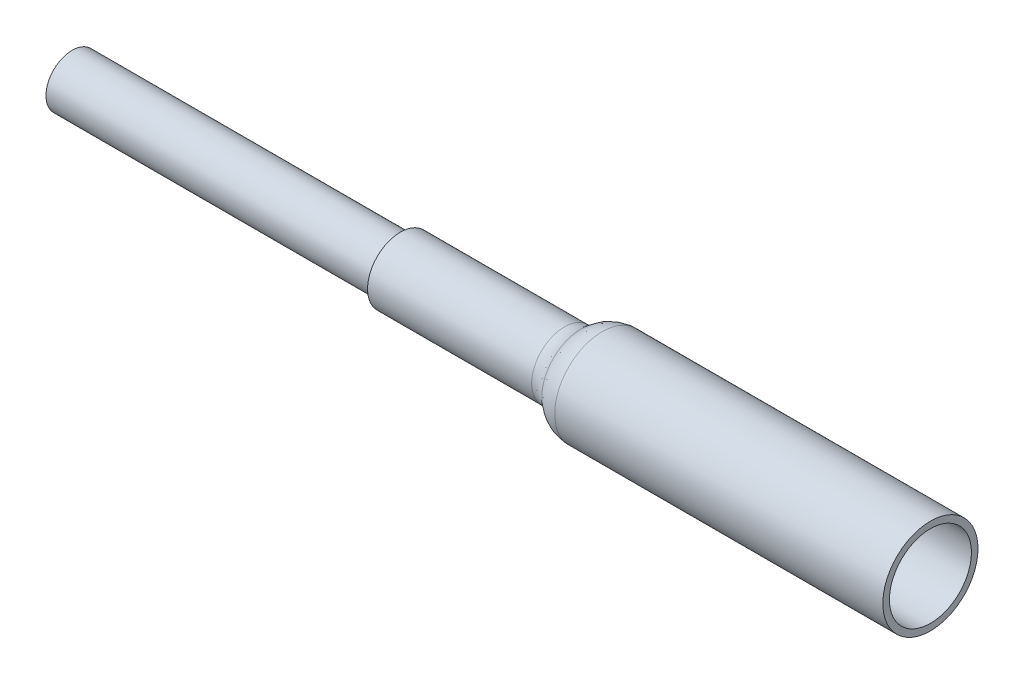
ISO-10303-21;
HEADER;
FILE_DESCRIPTION(('STEP AP214'),'2;1');
FILE_NAME('part.step','',(''),(''),'','','');
FILE_SCHEMA(('AUTOMOTIVE_DESIGN { 1 0 10303 214 1 1 1 1 }'));
ENDSEC;
DATA;
#1=APPLICATION_CONTEXT('core data for automotive mechanical design processes');
#2=APPLICATION_PROTOCOL_DEFINITION('international standard','automotive_design',2000,#1);
#3=PRODUCT_CONTEXT('',#1,'mechanical');
#4=PRODUCT('Part','Part','',(#3));
#5=PRODUCT_RELATED_PRODUCT_CATEGORY('part','',(#4));
#6=PRODUCT_DEFINITION_FORMATION('','',#4);
#7=PRODUCT_DEFINITION_CONTEXT('part definition',#1,'design');
#8=PRODUCT_DEFINITION('design','',#6,#7);
#9=PRODUCT_DEFINITION_SHAPE('','',#8);
#10=(LENGTH_UNIT() NAMED_UNIT(*) SI_UNIT(.MILLI.,.METRE.));
#11=(NAMED_UNIT(*) PLANE_ANGLE_UNIT() SI_UNIT($,.RADIAN.));
#12=(NAMED_UNIT(*) SI_UNIT($,.STERADIAN.) SOLID_ANGLE_UNIT());
#13=UNCERTAINTY_MEASURE_WITH_UNIT(LENGTH_MEASURE(1.E-05),#10,'distance_accuracy_value','');
#14=(GEOMETRIC_REPRESENTATION_CONTEXT(3) GLOBAL_UNCERTAINTY_ASSIGNED_CONTEXT((#13)) GLOBAL_UNIT_ASSIGNED_CONTEXT((#10,
#11,#12)) REPRESENTATION_CONTEXT('',''));
#15=CARTESIAN_POINT('',(0.,0.,0.));
#16=DIRECTION('',(0.,0.,1.));
#17=DIRECTION('',(1.,0.,0.));
#18=AXIS2_PLACEMENT_3D('',#15,#16,#17);
#19=CARTESIAN_POINT('',(25.593258264969,0.,-0.635000000000003));
#20=DIRECTION('',(1.,0.,0.));
#21=DIRECTION('',(0.,0.,-1.));
#22=AXIS2_PLACEMENT_3D('',#19,#20,#21);
#23=PLANE('',#22);
#24=CARTESIAN_POINT('',(25.593258264969,0.,0.));
#25=DIRECTION('',(1.,0.,0.));
#26=DIRECTION('',(0.,0.,-1.));
#27=AXIS2_PLACEMENT_3D('',#24,#25,#26);
#28=CIRCLE('',#27,0.635000000000003);
#29=CARTESIAN_POINT('',(25.593258264969,0.,-0.635000000000003));
#30=VERTEX_POINT('',#29);
#31=EDGE_CURVE('E10',#30,#30,#28,.T.);
#32=ORIENTED_EDGE('',*,*,#31,.T.);
#33=EDGE_LOOP('',(#32));
#34=FACE_BOUND('',#33,.T.);
#35=ADVANCED_FACE('F47',(#34),#23,.T.);
#36=CARTESIAN_POINT('',(25.593258264969,0.,0.));
#37=DIRECTION('',(1.,0.,0.));
#38=DIRECTION('',(0.,0.,-1.));
#39=AXIS2_PLACEMENT_3D('',#36,#37,#38);
#40=CYLINDRICAL_SURFACE('',#39,0.635000000000003);
#41=CARTESIAN_POINT('',(20.513258264969,0.,0.));
#42=DIRECTION('',(1.,0.,0.));
#43=DIRECTION('',(0.,0.,-1.));
#44=AXIS2_PLACEMENT_3D('',#41,#42,#43);
#45=CIRCLE('',#44,0.635000000000003);
#46=CARTESIAN_POINT('',(20.513258264969,0.,-0.635000000000003));
#47=VERTEX_POINT('',#46);
#48=EDGE_CURVE('E54',#47,#47,#45,.T.);
#49=ORIENTED_EDGE('',*,*,#48,.T.);
#50=EDGE_LOOP('',(#49));
#51=FACE_BOUND('',#50,.T.);
#52=ORIENTED_EDGE('',*,*,#31,.F.);
#53=EDGE_LOOP('',(#52));
#54=FACE_BOUND('',#53,.T.);
#55=ADVANCED_FACE('F123',(#51,#54),#40,.T.);
#56=CARTESIAN_POINT('',(20.513258264969,0.,-1.016));
#57=DIRECTION('',(1.,0.,0.));
#58=DIRECTION('',(0.,0.,-1.));
#59=AXIS2_PLACEMENT_3D('',#56,#57,#58);
#60=PLANE('',#59);
#61=CARTESIAN_POINT('',(20.513258264969,0.,0.));
#62=DIRECTION('',(1.,0.,0.));
#63=DIRECTION('',(0.,0.,-1.));
#64=AXIS2_PLACEMENT_3D('',#61,#62,#63);
#65=CIRCLE('',#64,1.016);
#66=CARTESIAN_POINT('',(20.513258264969,0.,-1.016));
#67=VERTEX_POINT('',#66);
#68=EDGE_CURVE('E59',#67,#67,#65,.T.);
#69=ORIENTED_EDGE('',*,*,#68,.T.);
#70=EDGE_LOOP('',(#69));
#71=FACE_BOUND('',#70,.T.);
#72=ORIENTED_EDGE('',*,*,#48,.F.);
#73=EDGE_LOOP('',(#72));
#74=FACE_BOUND('',#73,.T.);
#75=ADVANCED_FACE('F127',(#71,#74),#60,.T.);
#76=CARTESIAN_POINT('',(25.593258264969,0.,0.));
#77=DIRECTION('',(1.,0.,0.));
#78=DIRECTION('',(0.,0.,-1.));
#79=AXIS2_PLACEMENT_3D('',#76,#77,#78);
#80=CYLINDRICAL_SURFACE('',#79,1.016);
#81=CARTESIAN_POINT('',(19.05,0.,0.));
#82=DIRECTION('',(1.,0.,0.));
#83=DIRECTION('',(0.,0.,-1.));
#84=AXIS2_PLACEMENT_3D('',#81,#82,#83);
#85=CIRCLE('',#84,1.016);
#86=CARTESIAN_POINT('',(19.05,0.,-1.016));
#87=VERTEX_POINT('',#86);
#88=EDGE_CURVE('E64',#87,#87,#85,.T.);
#89=ORIENTED_EDGE('',*,*,#88,.T.);
#90=EDGE_LOOP('',(#89));
#91=FACE_BOUND('',#90,.T.);
#92=ORIENTED_EDGE('',*,*,#68,.F.);
#93=EDGE_LOOP('',(#92));
#94=FACE_BOUND('',#93,.T.);
#95=ADVANCED_FACE('F131',(#91,#94),#80,.T.);
#96=CARTESIAN_POINT('',(19.05,0.,0.));
#97=DIRECTION('',(1.,0.,0.));
#98=DIRECTION('',(0.,0.,-1.));
#99=AXIS2_PLACEMENT_3D('',#96,#97,#98);
#100=TOROIDAL_SURFACE('',#99,2.2225,1.2065);
#101=CARTESIAN_POINT('',(19.8677031480709,0.,0.));
#102=DIRECTION('',(1.,0.,0.));
#103=DIRECTION('',(0.,0.,-1.));
#104=AXIS2_PLACEMENT_3D('',#101,#102,#103);
#105=CIRCLE('',#104,1.33536764705883);
#106=CARTESIAN_POINT('',(19.8677031480709,0.,-1.33536764705883));
#107=VERTEX_POINT('',#106);
#108=EDGE_CURVE('E70',#107,#107,#105,.T.);
#109=ORIENTED_EDGE('',*,*,#108,.T.);
#110=EDGE_LOOP('',(#109));
#111=FACE_BOUND('',#110,.T.);
#112=ORIENTED_EDGE('',*,*,#88,.F.);
#113=EDGE_LOOP('',(#112));
#114=FACE_BOUND('',#113,.T.);
#115=ADVANCED_FACE('F138',(#111,#114),#100,.T.);
#116=CARTESIAN_POINT('',(20.513258264969,0.,0.));
#117=DIRECTION('',(1.,0.,0.));
#118=DIRECTION('',(0.,0.,-1.));
#119=AXIS2_PLACEMENT_3D('',#116,#117,#118);
#120=DEGENERATE_TOROIDAL_SURFACE('',#119,0.635000000000003,0.952500000000001,.T.);
#121=CARTESIAN_POINT('',(20.513258264969,0.,0.));
#122=DIRECTION('',(1.,0.,0.));
#123=DIRECTION('',(0.,0.,-1.));
#124=AXIS2_PLACEMENT_3D('',#121,#122,#123);
#125=CIRCLE('',#124,1.5875);
#126=CARTESIAN_POINT('',(20.513258264969,0.,-1.5875));
#127=VERTEX_POINT('',#126);
#128=EDGE_CURVE('E74',#127,#127,#125,.T.);
#129=ORIENTED_EDGE('',*,*,#128,.T.);
#130=EDGE_LOOP('',(#129));
#131=FACE_BOUND('',#130,.T.);
#132=ORIENTED_EDGE('',*,*,#108,.F.);
#133=EDGE_LOOP('',(#132));
#134=FACE_BOUND('',#133,.T.);
#135=ADVANCED_FACE('F142',(#131,#134),#120,.F.);
#136=CARTESIAN_POINT('',(25.593258264969,0.,0.));
#137=DIRECTION('',(1.,0.,0.));
#138=DIRECTION('',(0.,0.,-1.));
#139=AXIS2_PLACEMENT_3D('',#136,#137,#138);
#140=CYLINDRICAL_SURFACE('',#139,1.5875);
#141=CARTESIAN_POINT('',(33.213258264969,0.,0.));
#142=DIRECTION('',(1.,0.,0.));
#143=DIRECTION('',(0.,0.,-1.));
#144=AXIS2_PLACEMENT_3D('',#141,#142,#143);
#145=CIRCLE('',#144,1.5875);
#146=CARTESIAN_POINT('',(33.213258264969,0.,-1.5875));
#147=VERTEX_POINT('',#146);
#148=EDGE_CURVE('E78',#147,#147,#145,.T.);
#149=ORIENTED_EDGE('',*,*,#148,.T.);
#150=EDGE_LOOP('',(#149));
#151=FACE_BOUND('',#150,.T.);
#152=ORIENTED_EDGE('',*,*,#128,.F.);
#153=EDGE_LOOP('',(#152));
#154=FACE_BOUND('',#153,.T.);
#155=ADVANCED_FACE('F146',(#151,#154),#140,.F.);
#156=CARTESIAN_POINT('',(33.213258264969,0.,-1.8415));
#157=DIRECTION('',(1.,0.,0.));
#158=DIRECTION('',(0.,0.,-1.));
#159=AXIS2_PLACEMENT_3D('',#156,#157,#158);
#160=PLANE('',#159);
#161=CARTESIAN_POINT('',(33.213258264969,0.,0.));
#162=DIRECTION('',(1.,0.,0.));
#163=DIRECTION('',(0.,0.,-1.));
#164=AXIS2_PLACEMENT_3D('',#161,#162,#163);
#165=CIRCLE('',#164,1.8415);
#166=CARTESIAN_POINT('',(33.213258264969,0.,-1.8415));
#167=VERTEX_POINT('',#166);
#168=EDGE_CURVE('E82',#167,#167,#165,.T.);
#169=ORIENTED_EDGE('',*,*,#168,.T.);
#170=EDGE_LOOP('',(#169));
#171=FACE_BOUND('',#170,.T.);
#172=ORIENTED_EDGE('',*,*,#148,.F.);
#173=EDGE_LOOP('',(#172));
#174=FACE_BOUND('',#173,.T.);
#175=ADVANCED_FACE('F150',(#171,#174),#160,.T.);
#176=CARTESIAN_POINT('',(25.593258264969,0.,0.));
#177=DIRECTION('',(1.,0.,0.));
#178=DIRECTION('',(0.,0.,-1.));
#179=AXIS2_PLACEMENT_3D('',#176,#177,#178);
#180=CYLINDRICAL_SURFACE('',#179,1.8415);
#181=CARTESIAN_POINT('',(20.513258264969,0.,0.));
#182=DIRECTION('',(1.,0.,0.));
#183=DIRECTION('',(0.,0.,-1.));
#184=AXIS2_PLACEMENT_3D('',#181,#182,#183);
#185=CIRCLE('',#184,1.8415);
#186=CARTESIAN_POINT('',(20.513258264969,0.,-1.8415));
#187=VERTEX_POINT('',#186);
#188=EDGE_CURVE('E86',#187,#187,#185,.T.);
#189=ORIENTED_EDGE('',*,*,#188,.T.);
#190=EDGE_LOOP('',(#189));
#191=FACE_BOUND('',#190,.T.);
#192=ORIENTED_EDGE('',*,*,#168,.F.);
#193=EDGE_LOOP('',(#192));
#194=FACE_BOUND('',#193,.T.);
#195=ADVANCED_FACE('F154',(#191,#194),#180,.T.);
#196=CARTESIAN_POINT('',(20.513258264969,0.,0.));
#197=DIRECTION('',(1.,0.,0.));
#198=DIRECTION('',(0.,0.,-1.));
#199=AXIS2_PLACEMENT_3D('',#196,#197,#198);
#200=DEGENERATE_TOROIDAL_SURFACE('',#199,0.635000000000003,1.2065,.T.);
#201=CARTESIAN_POINT('',(19.6955551168981,0.,0.));
#202=DIRECTION('',(1.,0.,0.));
#203=DIRECTION('',(0.,0.,-1.));
#204=AXIS2_PLACEMENT_3D('',#201,#202,#203);
#205=CIRCLE('',#204,1.52213235294118);
#206=CARTESIAN_POINT('',(19.6955551168981,0.,-1.52213235294118));
#207=VERTEX_POINT('',#206);
#208=EDGE_CURVE('E90',#207,#207,#205,.T.);
#209=ORIENTED_EDGE('',*,*,#208,.T.);
#210=EDGE_LOOP('',(#209));
#211=FACE_BOUND('',#210,.T.);
#212=ORIENTED_EDGE('',*,*,#188,.F.);
#213=EDGE_LOOP('',(#212));
#214=FACE_BOUND('',#213,.T.);
#215=ADVANCED_FACE('F158',(#211,#214),#200,.T.);
#216=CARTESIAN_POINT('',(19.05,0.,0.));
#217=DIRECTION('',(1.,0.,0.));
#218=DIRECTION('',(0.,0.,-1.));
#219=AXIS2_PLACEMENT_3D('',#216,#217,#218);
#220=TOROIDAL_SURFACE('',#219,2.2225,0.9525);
#221=CARTESIAN_POINT('',(19.05,0.,0.));
#222=DIRECTION('',(1.,0.,0.));
#223=DIRECTION('',(0.,0.,-1.));
#224=AXIS2_PLACEMENT_3D('',#221,#222,#223);
#225=CIRCLE('',#224,1.27);
#226=CARTESIAN_POINT('',(19.05,0.,-1.27));
#227=VERTEX_POINT('',#226);
#228=EDGE_CURVE('E94',#227,#227,#225,.T.);
#229=ORIENTED_EDGE('',*,*,#228,.T.);
#230=EDGE_LOOP('',(#229));
#231=FACE_BOUND('',#230,.T.);
#232=ORIENTED_EDGE('',*,*,#208,.F.);
#233=EDGE_LOOP('',(#232));
#234=FACE_BOUND('',#233,.T.);
#235=ADVANCED_FACE('F162',(#231,#234),#220,.F.);
#236=CARTESIAN_POINT('',(25.593258264969,0.,0.));
#237=DIRECTION('',(1.,0.,0.));
#238=DIRECTION('',(0.,0.,-1.));
#239=AXIS2_PLACEMENT_3D('',#236,#237,#238);
#240=CYLINDRICAL_SURFACE('',#239,1.27);
#241=CARTESIAN_POINT('',(12.7,0.,0.));
#242=DIRECTION('',(1.,0.,0.));
#243=DIRECTION('',(0.,0.,-1.));
#244=AXIS2_PLACEMENT_3D('',#241,#242,#243);
#245=CIRCLE('',#244,1.27);
#246=CARTESIAN_POINT('',(12.7,0.,-1.27));
#247=VERTEX_POINT('',#246);
#248=EDGE_CURVE('E98',#247,#247,#245,.T.);
#249=ORIENTED_EDGE('',*,*,#248,.T.);
#250=EDGE_LOOP('',(#249));
#251=FACE_BOUND('',#250,.T.);
#252=ORIENTED_EDGE('',*,*,#228,.F.);
#253=EDGE_LOOP('',(#252));
#254=FACE_BOUND('',#253,.T.);
#255=ADVANCED_FACE('F166',(#251,#254),#240,.T.);
#256=CARTESIAN_POINT('',(12.7,0.,-1.016));
#257=DIRECTION('',(-1.,0.,0.));
#258=DIRECTION('',(0.,0.,1.));
#259=AXIS2_PLACEMENT_3D('',#256,#257,#258);
#260=PLANE('',#259);
#261=CARTESIAN_POINT('',(12.7,0.,0.));
#262=DIRECTION('',(1.,0.,0.));
#263=DIRECTION('',(0.,0.,-1.));
#264=AXIS2_PLACEMENT_3D('',#261,#262,#263);
#265=CIRCLE('',#264,1.016);
#266=CARTESIAN_POINT('',(12.7,0.,-1.016));
#267=VERTEX_POINT('',#266);
#268=EDGE_CURVE('E102',#267,#267,#265,.T.);
#269=ORIENTED_EDGE('',*,*,#268,.T.);
#270=EDGE_LOOP('',(#269));
#271=FACE_BOUND('',#270,.T.);
#272=ORIENTED_EDGE('',*,*,#248,.F.);
#273=EDGE_LOOP('',(#272));
#274=FACE_BOUND('',#273,.T.);
#275=ADVANCED_FACE('F120',(#271,#274),#260,.T.);
#276=CARTESIAN_POINT('',(25.593258264969,0.,0.));
#277=DIRECTION('',(1.,0.,0.));
#278=DIRECTION('',(0.,0.,-1.));
#279=AXIS2_PLACEMENT_3D('',#276,#277,#278);
#280=CYLINDRICAL_SURFACE('',#279,1.016);
#281=CARTESIAN_POINT('',(0.,0.,0.));
#282=DIRECTION('',(1.,0.,0.));
#283=DIRECTION('',(0.,0.,-1.));
#284=AXIS2_PLACEMENT_3D('',#281,#282,#283);
#285=CIRCLE('',#284,1.016);
#286=CARTESIAN_POINT('',(0.,0.,-1.016));
#287=VERTEX_POINT('',#286);
#288=EDGE_CURVE('E106',#287,#287,#285,.T.);
#289=ORIENTED_EDGE('',*,*,#288,.T.);
#290=EDGE_LOOP('',(#289));
#291=FACE_BOUND('',#290,.T.);
#292=ORIENTED_EDGE('',*,*,#268,.F.);
#293=EDGE_LOOP('',(#292));
#294=FACE_BOUND('',#293,.T.);
#295=ADVANCED_FACE('F111',(#291,#294),#280,.T.);
#296=CARTESIAN_POINT('',(0.,0.,0.));
#297=DIRECTION('',(-1.,0.,0.));
#298=DIRECTION('',(0.,0.,1.));
#299=AXIS2_PLACEMENT_3D('',#296,#297,#298);
#300=PLANE('',#299);
#301=ORIENTED_EDGE('',*,*,#288,.F.);
#302=EDGE_LOOP('',(#301));
#303=FACE_BOUND('',#302,.T.);
#304=ADVANCED_FACE('F114',(#303),#300,.T.);
#305=CLOSED_SHELL('',(#35,#55,#75,#95,#115,#135,#155,#175,#195,#215,#235,#255,#275,#295,#304));
#306=MANIFOLD_SOLID_BREP('B2',#305);
#307=ADVANCED_BREP_SHAPE_REPRESENTATION('',(#18,#306),#14);
#308=SHAPE_DEFINITION_REPRESENTATION(#9,#307);
ENDSEC;
END-ISO-10303-21;
